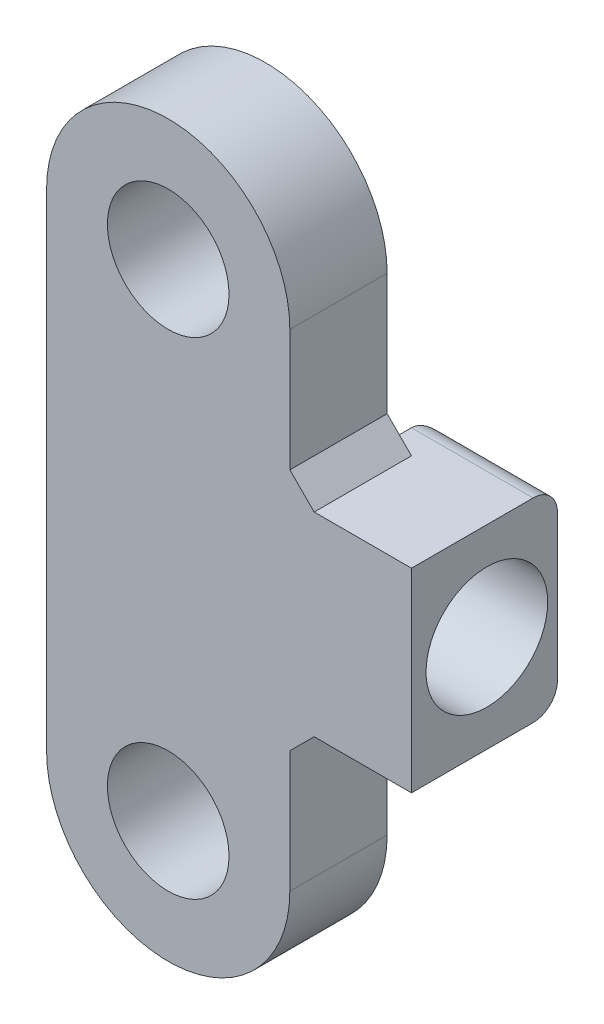
ISO-10303-21;
HEADER;
FILE_DESCRIPTION(('STEP AP214'),'2;1');
FILE_NAME('part.step','',(''),(''),'','','');
FILE_SCHEMA(('AUTOMOTIVE_DESIGN { 1 0 10303 214 1 1 1 1 }'));
ENDSEC;
DATA;
#1=APPLICATION_CONTEXT('core data for automotive mechanical design processes');
#2=APPLICATION_PROTOCOL_DEFINITION('international standard','automotive_design',2000,#1);
#3=PRODUCT_CONTEXT('',#1,'mechanical');
#4=PRODUCT('Part','Part','',(#3));
#5=PRODUCT_RELATED_PRODUCT_CATEGORY('part','',(#4));
#6=PRODUCT_DEFINITION_FORMATION('','',#4);
#7=PRODUCT_DEFINITION_CONTEXT('part definition',#1,'design');
#8=PRODUCT_DEFINITION('design','',#6,#7);
#9=PRODUCT_DEFINITION_SHAPE('','',#8);
#10=(LENGTH_UNIT() NAMED_UNIT(*) SI_UNIT(.MILLI.,.METRE.));
#11=(NAMED_UNIT(*) PLANE_ANGLE_UNIT() SI_UNIT($,.RADIAN.));
#12=(NAMED_UNIT(*) SI_UNIT($,.STERADIAN.) SOLID_ANGLE_UNIT());
#13=UNCERTAINTY_MEASURE_WITH_UNIT(LENGTH_MEASURE(1.E-05),#10,'distance_accuracy_value','');
#14=(GEOMETRIC_REPRESENTATION_CONTEXT(3) GLOBAL_UNCERTAINTY_ASSIGNED_CONTEXT((#13)) GLOBAL_UNIT_ASSIGNED_CONTEXT((#10,
#11,#12)) REPRESENTATION_CONTEXT('',''));
#15=CARTESIAN_POINT('',(0.,0.,0.));
#16=DIRECTION('',(0.,0.,1.));
#17=DIRECTION('',(1.,0.,0.));
#18=AXIS2_PLACEMENT_3D('',#15,#16,#17);
#19=CARTESIAN_POINT('',(5.,0.,0.));
#20=DIRECTION('',(1.,0.,0.));
#21=DIRECTION('',(0.,0.,-1.));
#22=AXIS2_PLACEMENT_3D('',#19,#20,#21);
#23=PLANE('',#22);
#24=DIRECTION('',(0.,0.,1.));
#25=VECTOR('',#24,1.);
#26=CARTESIAN_POINT('',(5.,4.,4.));
#27=LINE('',#26,#25);
#28=CARTESIAN_POINT('',(5.,4.,-1.));
#29=VERTEX_POINT('',#28);
#30=CARTESIAN_POINT('',(5.,4.,0.));
#31=VERTEX_POINT('',#30);
#32=EDGE_CURVE('E180',#29,#31,#27,.T.);
#33=ORIENTED_EDGE('',*,*,#32,.F.);
#34=DIRECTION('',(0.,1.,0.));
#35=VECTOR('',#34,1.);
#36=CARTESIAN_POINT('',(5.,0.,-1.));
#37=LINE('',#36,#35);
#38=CARTESIAN_POINT('',(5.,1.62480768092719,-1.));
#39=VERTEX_POINT('',#38);
#40=EDGE_CURVE('E52',#29,#39,#37,.F.);
#41=ORIENTED_EDGE('',*,*,#40,.T.);
#42=CARTESIAN_POINT('',(5.,0.,0.9));
#43=DIRECTION('',(1.,0.,0.));
#44=DIRECTION('',(0.,0.,-1.));
#45=AXIS2_PLACEMENT_3D('',#42,#43,#44);
#46=CIRCLE('',#45,2.5);
#47=CARTESIAN_POINT('',(5.,2.33238075793812,0.));
#48=VERTEX_POINT('',#47);
#49=EDGE_CURVE('E373',#39,#48,#46,.T.);
#50=ORIENTED_EDGE('',*,*,#49,.T.);
#51=DIRECTION('',(0.,-1.,0.));
#52=VECTOR('',#51,1.);
#53=CARTESIAN_POINT('',(5.,0.,0.));
#54=LINE('',#53,#52);
#55=EDGE_CURVE('E227',#31,#48,#54,.T.);
#56=ORIENTED_EDGE('',*,*,#55,.F.);
#57=EDGE_LOOP('',(#33,#41,#50,#56));
#58=FACE_BOUND('',#57,.T.);
#59=ADVANCED_FACE('F43',(#58),#23,.F.);
#60=CARTESIAN_POINT('',(5.,0.,4.));
#61=DIRECTION('',(1.,0.,0.));
#62=DIRECTION('',(0.,0.,-1.));
#63=AXIS2_PLACEMENT_3D('',#60,#61,#62);
#64=PLANE('',#63);
#65=CARTESIAN_POINT('',(5.,-5.,0.));
#66=VERTEX_POINT('',#65);
#67=CARTESIAN_POINT('',(5.,-10.,0.));
#68=VERTEX_POINT('',#67);
#69=EDGE_CURVE('E223',#66,#68,#54,.T.);
#70=ORIENTED_EDGE('',*,*,#69,.F.);
#71=DIRECTION('',(0.,0.,1.));
#72=VECTOR('',#71,1.);
#73=CARTESIAN_POINT('',(5.,-5.,4.));
#74=LINE('',#73,#72);
#75=CARTESIAN_POINT('',(5.,-5.,4.));
#76=VERTEX_POINT('',#75);
#77=EDGE_CURVE('E243',#66,#76,#74,.T.);
#78=ORIENTED_EDGE('',*,*,#77,.T.);
#79=DIRECTION('',(0.,-1.,0.));
#80=VECTOR('',#79,1.);
#81=CARTESIAN_POINT('',(5.,0.,4.));
#82=LINE('',#81,#80);
#83=CARTESIAN_POINT('',(5.,-10.,4.));
#84=VERTEX_POINT('',#83);
#85=EDGE_CURVE('E208',#76,#84,#82,.T.);
#86=ORIENTED_EDGE('',*,*,#85,.T.);
#87=DIRECTION('',(0.,0.,-1.));
#88=VECTOR('',#87,1.);
#89=CARTESIAN_POINT('',(5.,-10.,4.));
#90=LINE('',#89,#88);
#91=EDGE_CURVE('E233',#84,#68,#90,.T.);
#92=ORIENTED_EDGE('',*,*,#91,.T.);
#93=EDGE_LOOP('',(#70,#78,#86,#92));
#94=FACE_BOUND('',#93,.T.);
#95=ADVANCED_FACE('F330',(#94),#64,.T.);
#96=CARTESIAN_POINT('',(5.,-2.33238075793812,0.));
#97=VERTEX_POINT('',#96);
#98=EDGE_CURVE('E388',#48,#97,#46,.T.);
#99=ORIENTED_EDGE('',*,*,#98,.T.);
#100=EDGE_CURVE('E399',#48,#97,#54,.T.);
#101=ORIENTED_EDGE('',*,*,#100,.F.);
#102=EDGE_LOOP('',(#99,#101));
#103=FACE_BOUND('',#102,.T.);
#104=ADVANCED_FACE('F322',(#103),#64,.T.);
#105=CARTESIAN_POINT('',(-5.,0.,4.));
#106=DIRECTION('',(1.,0.,0.));
#107=DIRECTION('',(0.,0.,-1.));
#108=AXIS2_PLACEMENT_3D('',#105,#106,#107);
#109=PLANE('',#108);
#110=DIRECTION('',(0.,-1.,0.));
#111=VECTOR('',#110,1.);
#112=CARTESIAN_POINT('',(-5.,0.,0.));
#113=LINE('',#112,#111);
#114=CARTESIAN_POINT('',(-5.,10.,0.));
#115=VERTEX_POINT('',#114);
#116=CARTESIAN_POINT('',(-5.,-10.,0.));
#117=VERTEX_POINT('',#116);
#118=EDGE_CURVE('E217',#115,#117,#113,.T.);
#119=ORIENTED_EDGE('',*,*,#118,.T.);
#120=DIRECTION('',(0.,0.,-1.));
#121=VECTOR('',#120,1.);
#122=CARTESIAN_POINT('',(-5.,-10.,4.));
#123=LINE('',#122,#121);
#124=CARTESIAN_POINT('',(-5.,-10.,4.));
#125=VERTEX_POINT('',#124);
#126=EDGE_CURVE('E236',#125,#117,#123,.T.);
#127=ORIENTED_EDGE('',*,*,#126,.F.);
#128=DIRECTION('',(0.,-1.,0.));
#129=VECTOR('',#128,1.);
#130=CARTESIAN_POINT('',(-5.,0.,4.));
#131=LINE('',#130,#129);
#132=CARTESIAN_POINT('',(-5.,10.,4.));
#133=VERTEX_POINT('',#132);
#134=EDGE_CURVE('E203',#133,#125,#131,.T.);
#135=ORIENTED_EDGE('',*,*,#134,.F.);
#136=DIRECTION('',(0.,0.,-1.));
#137=VECTOR('',#136,1.);
#138=CARTESIAN_POINT('',(-5.,10.,4.));
#139=LINE('',#138,#137);
#140=EDGE_CURVE('E213',#133,#115,#139,.T.);
#141=ORIENTED_EDGE('',*,*,#140,.T.);
#142=EDGE_LOOP('',(#119,#127,#135,#141));
#143=FACE_BOUND('',#142,.T.);
#144=ADVANCED_FACE('F318',(#143),#109,.F.);
#145=CARTESIAN_POINT('',(0.,-10.,4.));
#146=DIRECTION('',(0.,0.,-1.));
#147=DIRECTION('',(-1.,0.,0.));
#148=AXIS2_PLACEMENT_3D('',#145,#146,#147);
#149=CYLINDRICAL_SURFACE('',#148,5.);
#150=CARTESIAN_POINT('',(0.,-10.,0.));
#151=DIRECTION('',(0.,0.,1.));
#152=DIRECTION('',(1.,0.,0.));
#153=AXIS2_PLACEMENT_3D('',#150,#151,#152);
#154=CIRCLE('',#153,5.);
#155=EDGE_CURVE('E220',#117,#68,#154,.T.);
#156=ORIENTED_EDGE('',*,*,#155,.T.);
#157=ORIENTED_EDGE('',*,*,#91,.F.);
#158=CARTESIAN_POINT('',(0.,-10.,4.));
#159=DIRECTION('',(0.,0.,1.));
#160=DIRECTION('',(1.,0.,0.));
#161=AXIS2_PLACEMENT_3D('',#158,#159,#160);
#162=CIRCLE('',#161,5.);
#163=EDGE_CURVE('E205',#125,#84,#162,.T.);
#164=ORIENTED_EDGE('',*,*,#163,.F.);
#165=ORIENTED_EDGE('',*,*,#126,.T.);
#166=EDGE_LOOP('',(#156,#157,#164,#165));
#167=FACE_BOUND('',#166,.T.);
#168=ADVANCED_FACE('F321',(#167),#149,.T.);
#169=CARTESIAN_POINT('',(5.,10.,4.));
#170=VERTEX_POINT('',#169);
#171=CARTESIAN_POINT('',(5.,5.,4.));
#172=VERTEX_POINT('',#171);
#173=EDGE_CURVE('E209',#170,#172,#82,.T.);
#174=ORIENTED_EDGE('',*,*,#173,.T.);
#175=DIRECTION('',(0.,0.,-1.));
#176=VECTOR('',#175,1.);
#177=CARTESIAN_POINT('',(5.,5.,4.));
#178=LINE('',#177,#176);
#179=CARTESIAN_POINT('',(5.,5.,0.));
#180=VERTEX_POINT('',#179);
#181=EDGE_CURVE('E251',#172,#180,#178,.T.);
#182=ORIENTED_EDGE('',*,*,#181,.T.);
#183=CARTESIAN_POINT('',(5.,10.,0.));
#184=VERTEX_POINT('',#183);
#185=EDGE_CURVE('E224',#184,#180,#54,.T.);
#186=ORIENTED_EDGE('',*,*,#185,.F.);
#187=DIRECTION('',(0.,0.,-1.));
#188=VECTOR('',#187,1.);
#189=CARTESIAN_POINT('',(5.,10.,4.));
#190=LINE('',#189,#188);
#191=EDGE_CURVE('E231',#170,#184,#190,.T.);
#192=ORIENTED_EDGE('',*,*,#191,.F.);
#193=EDGE_LOOP('',(#174,#182,#186,#192));
#194=FACE_BOUND('',#193,.T.);
#195=ADVANCED_FACE('F316',(#194),#64,.T.);
#196=CARTESIAN_POINT('',(0.,10.,4.));
#197=DIRECTION('',(0.,0.,-1.));
#198=DIRECTION('',(-1.,0.,0.));
#199=AXIS2_PLACEMENT_3D('',#196,#197,#198);
#200=CYLINDRICAL_SURFACE('',#199,2.5);
#201=CARTESIAN_POINT('',(0.,10.,4.));
#202=DIRECTION('',(0.,0.,1.));
#203=DIRECTION('',(1.,0.,0.));
#204=AXIS2_PLACEMENT_3D('',#201,#202,#203);
#205=CIRCLE('',#204,2.5);
#206=CARTESIAN_POINT('',(2.5,10.,4.));
#207=VERTEX_POINT('',#206);
#208=EDGE_CURVE('E199',#207,#207,#205,.T.);
#209=ORIENTED_EDGE('',*,*,#208,.T.);
#210=EDGE_LOOP('',(#209));
#211=FACE_BOUND('',#210,.T.);
#212=CARTESIAN_POINT('',(0.,10.,0.));
#213=DIRECTION('',(0.,0.,1.));
#214=DIRECTION('',(1.,0.,0.));
#215=AXIS2_PLACEMENT_3D('',#212,#213,#214);
#216=CIRCLE('',#215,2.5);
#217=CARTESIAN_POINT('',(2.5,10.,0.));
#218=VERTEX_POINT('',#217);
#219=EDGE_CURVE('E191',#218,#218,#216,.T.);
#220=ORIENTED_EDGE('',*,*,#219,.F.);
#221=EDGE_LOOP('',(#220));
#222=FACE_BOUND('',#221,.T.);
#223=ADVANCED_FACE('F312',(#211,#222),#200,.F.);
#224=CARTESIAN_POINT('',(0.,-10.,4.));
#225=DIRECTION('',(0.,0.,-1.));
#226=DIRECTION('',(-1.,0.,0.));
#227=AXIS2_PLACEMENT_3D('',#224,#225,#226);
#228=CYLINDRICAL_SURFACE('',#227,2.5);
#229=CARTESIAN_POINT('',(0.,-10.,4.));
#230=DIRECTION('',(0.,0.,1.));
#231=DIRECTION('',(1.,0.,0.));
#232=AXIS2_PLACEMENT_3D('',#229,#230,#231);
#233=CIRCLE('',#232,2.5);
#234=CARTESIAN_POINT('',(2.5,-10.,4.));
#235=VERTEX_POINT('',#234);
#236=EDGE_CURVE('E196',#235,#235,#233,.T.);
#237=ORIENTED_EDGE('',*,*,#236,.T.);
#238=EDGE_LOOP('',(#237));
#239=FACE_BOUND('',#238,.T.);
#240=CARTESIAN_POINT('',(0.,-10.,0.));
#241=DIRECTION('',(0.,0.,1.));
#242=DIRECTION('',(1.,0.,0.));
#243=AXIS2_PLACEMENT_3D('',#240,#241,#242);
#244=CIRCLE('',#243,2.5);
#245=CARTESIAN_POINT('',(2.5,-10.,0.));
#246=VERTEX_POINT('',#245);
#247=EDGE_CURVE('E187',#246,#246,#244,.T.);
#248=ORIENTED_EDGE('',*,*,#247,.F.);
#249=EDGE_LOOP('',(#248));
#250=FACE_BOUND('',#249,.T.);
#251=ADVANCED_FACE('F308',(#239,#250),#228,.F.);
#252=CARTESIAN_POINT('',(0.,10.,4.));
#253=DIRECTION('',(0.,0.,-1.));
#254=DIRECTION('',(-1.,0.,0.));
#255=AXIS2_PLACEMENT_3D('',#252,#253,#254);
#256=CYLINDRICAL_SURFACE('',#255,5.);
#257=CARTESIAN_POINT('',(0.,10.,0.));
#258=DIRECTION('',(0.,0.,1.));
#259=DIRECTION('',(1.,0.,0.));
#260=AXIS2_PLACEMENT_3D('',#257,#258,#259);
#261=CIRCLE('',#260,5.);
#262=EDGE_CURVE('E200',#184,#115,#261,.T.);
#263=ORIENTED_EDGE('',*,*,#262,.T.);
#264=ORIENTED_EDGE('',*,*,#140,.F.);
#265=CARTESIAN_POINT('',(0.,10.,4.));
#266=DIRECTION('',(0.,0.,1.));
#267=DIRECTION('',(1.,0.,0.));
#268=AXIS2_PLACEMENT_3D('',#265,#266,#267);
#269=CIRCLE('',#268,5.);
#270=EDGE_CURVE('E212',#170,#133,#269,.T.);
#271=ORIENTED_EDGE('',*,*,#270,.F.);
#272=ORIENTED_EDGE('',*,*,#191,.T.);
#273=EDGE_LOOP('',(#263,#264,#271,#272));
#274=FACE_BOUND('',#273,.T.);
#275=ADVANCED_FACE('F311',(#274),#256,.T.);
#276=CARTESIAN_POINT('',(0.,0.,4.));
#277=DIRECTION('',(0.,0.,1.));
#278=DIRECTION('',(1.,0.,0.));
#279=AXIS2_PLACEMENT_3D('',#276,#277,#278);
#280=PLANE('',#279);
#281=ORIENTED_EDGE('',*,*,#236,.F.);
#282=EDGE_LOOP('',(#281));
#283=FACE_BOUND('',#282,.T.);
#284=ORIENTED_EDGE('',*,*,#208,.F.);
#285=EDGE_LOOP('',(#284));
#286=FACE_BOUND('',#285,.T.);
#287=ORIENTED_EDGE('',*,*,#134,.T.);
#288=ORIENTED_EDGE('',*,*,#163,.T.);
#289=ORIENTED_EDGE('',*,*,#85,.F.);
#290=DIRECTION('',(0.707106781186551,0.707106781186544,0.));
#291=VECTOR('',#290,1.);
#292=CARTESIAN_POINT('',(6.00000000000001,-4.,4.));
#293=LINE('',#292,#291);
#294=CARTESIAN_POINT('',(6.00000000000001,-4.,4.));
#295=VERTEX_POINT('',#294);
#296=EDGE_CURVE('E186',#76,#295,#293,.T.);
#297=ORIENTED_EDGE('',*,*,#296,.T.);
#298=DIRECTION('',(-1.,0.,0.));
#299=VECTOR('',#298,1.);
#300=CARTESIAN_POINT('',(10.,-4.,4.));
#301=LINE('',#300,#299);
#302=CARTESIAN_POINT('',(10.,-4.,4.));
#303=VERTEX_POINT('',#302);
#304=EDGE_CURVE('E163',#303,#295,#301,.T.);
#305=ORIENTED_EDGE('',*,*,#304,.F.);
#306=DIRECTION('',(0.,-1.,0.));
#307=VECTOR('',#306,1.);
#308=CARTESIAN_POINT('',(10.,4.,4.));
#309=LINE('',#308,#307);
#310=CARTESIAN_POINT('',(10.,4.,4.));
#311=VERTEX_POINT('',#310);
#312=EDGE_CURVE('E170',#311,#303,#309,.T.);
#313=ORIENTED_EDGE('',*,*,#312,.F.);
#314=DIRECTION('',(-1.,0.,0.));
#315=VECTOR('',#314,1.);
#316=CARTESIAN_POINT('',(10.,4.,4.));
#317=LINE('',#316,#315);
#318=CARTESIAN_POINT('',(6.00000000000001,4.,4.));
#319=VERTEX_POINT('',#318);
#320=EDGE_CURVE('E188',#311,#319,#317,.T.);
#321=ORIENTED_EDGE('',*,*,#320,.T.);
#322=DIRECTION('',(-0.707106781186551,0.707106781186544,0.));
#323=VECTOR('',#322,1.);
#324=CARTESIAN_POINT('',(6.00000000000001,4.,4.));
#325=LINE('',#324,#323);
#326=EDGE_CURVE('E256',#319,#172,#325,.T.);
#327=ORIENTED_EDGE('',*,*,#326,.T.);
#328=ORIENTED_EDGE('',*,*,#173,.F.);
#329=ORIENTED_EDGE('',*,*,#270,.T.);
#330=EDGE_LOOP('',(#287,#288,#289,#297,#305,#313,#321,#327,#328,#329));
#331=FACE_BOUND('',#330,.T.);
#332=ADVANCED_FACE('F183',(#283,#286,#331),#280,.T.);
#333=CARTESIAN_POINT('',(0.,0.,0.));
#334=DIRECTION('',(0.,0.,1.));
#335=DIRECTION('',(1.,0.,0.));
#336=AXIS2_PLACEMENT_3D('',#333,#334,#335);
#337=PLANE('',#336);
#338=ORIENTED_EDGE('',*,*,#247,.T.);
#339=EDGE_LOOP('',(#338));
#340=FACE_BOUND('',#339,.T.);
#341=ORIENTED_EDGE('',*,*,#219,.T.);
#342=EDGE_LOOP('',(#341));
#343=FACE_BOUND('',#342,.T.);
#344=ORIENTED_EDGE('',*,*,#118,.F.);
#345=ORIENTED_EDGE('',*,*,#262,.F.);
#346=ORIENTED_EDGE('',*,*,#185,.T.);
#347=DIRECTION('',(0.707106781186551,-0.707106781186544,0.));
#348=VECTOR('',#347,1.);
#349=CARTESIAN_POINT('',(4.99999999999997,5.00000000000002,0.));
#350=LINE('',#349,#348);
#351=CARTESIAN_POINT('',(6.00000000000001,4.,0.));
#352=VERTEX_POINT('',#351);
#353=EDGE_CURVE('E258',#180,#352,#350,.T.);
#354=ORIENTED_EDGE('',*,*,#353,.T.);
#355=DIRECTION('',(1.,0.,0.));
#356=VECTOR('',#355,1.);
#357=CARTESIAN_POINT('',(0.,4.,0.));
#358=LINE('',#357,#356);
#359=EDGE_CURVE('E245',#31,#352,#358,.T.);
#360=ORIENTED_EDGE('',*,*,#359,.F.);
#361=ORIENTED_EDGE('',*,*,#55,.T.);
#362=ORIENTED_EDGE('',*,*,#100,.T.);
#363=CARTESIAN_POINT('',(5.,-4.,0.));
#364=VERTEX_POINT('',#363);
#365=EDGE_CURVE('E401',#97,#364,#54,.T.);
#366=ORIENTED_EDGE('',*,*,#365,.T.);
#367=DIRECTION('',(-1.,0.,0.));
#368=VECTOR('',#367,1.);
#369=CARTESIAN_POINT('',(0.,-4.,0.));
#370=LINE('',#369,#368);
#371=CARTESIAN_POINT('',(6.00000000000001,-4.,0.));
#372=VERTEX_POINT('',#371);
#373=EDGE_CURVE('E239',#372,#364,#370,.T.);
#374=ORIENTED_EDGE('',*,*,#373,.F.);
#375=DIRECTION('',(-0.707106781186551,-0.707106781186544,0.));
#376=VECTOR('',#375,1.);
#377=CARTESIAN_POINT('',(4.99999999999997,-5.00000000000002,0.));
#378=LINE('',#377,#376);
#379=EDGE_CURVE('E253',#372,#66,#378,.T.);
#380=ORIENTED_EDGE('',*,*,#379,.T.);
#381=ORIENTED_EDGE('',*,*,#69,.T.);
#382=ORIENTED_EDGE('',*,*,#155,.F.);
#383=EDGE_LOOP('',(#344,#345,#346,#354,#360,#361,#362,#366,#374,#380,#381,#382));
#384=FACE_BOUND('',#383,.T.);
#385=ADVANCED_FACE('F334',(#340,#343,#384),#337,.F.);
#386=CARTESIAN_POINT('',(5.,-1.62480768092719,-1.));
#387=VERTEX_POINT('',#386);
#388=EDGE_CURVE('E378',#97,#387,#46,.T.);
#389=ORIENTED_EDGE('',*,*,#388,.T.);
#390=DIRECTION('',(0.,1.,0.));
#391=VECTOR('',#390,1.);
#392=CARTESIAN_POINT('',(5.,0.,-1.));
#393=LINE('',#392,#391);
#394=CARTESIAN_POINT('',(5.,-4.,-1.));
#395=VERTEX_POINT('',#394);
#396=EDGE_CURVE('E274',#387,#395,#393,.F.);
#397=ORIENTED_EDGE('',*,*,#396,.T.);
#398=DIRECTION('',(0.,0.,-1.));
#399=VECTOR('',#398,1.);
#400=CARTESIAN_POINT('',(5.,-4.,4.));
#401=LINE('',#400,#399);
#402=EDGE_CURVE('E366',#364,#395,#401,.T.);
#403=ORIENTED_EDGE('',*,*,#402,.F.);
#404=ORIENTED_EDGE('',*,*,#365,.F.);
#405=EDGE_LOOP('',(#389,#397,#403,#404));
#406=FACE_BOUND('',#405,.T.);
#407=ADVANCED_FACE('F337',(#406),#23,.F.);
#408=CARTESIAN_POINT('',(10.,0.,0.));
#409=DIRECTION('',(1.,0.,0.));
#410=DIRECTION('',(0.,0.,-1.));
#411=AXIS2_PLACEMENT_3D('',#408,#409,#410);
#412=PLANE('',#411);
#413=DIRECTION('',(0.,0.,-1.));
#414=VECTOR('',#413,1.);
#415=CARTESIAN_POINT('',(10.,-4.,4.));
#416=LINE('',#415,#414);
#417=CARTESIAN_POINT('',(10.,-4.,-1.));
#418=VERTEX_POINT('',#417);
#419=EDGE_CURVE('E157',#303,#418,#416,.T.);
#420=ORIENTED_EDGE('',*,*,#419,.T.);
#421=CARTESIAN_POINT('',(10.,-3.,-1.));
#422=DIRECTION('',(1.,0.,0.));
#423=DIRECTION('',(0.,0.,-1.));
#424=AXIS2_PLACEMENT_3D('',#421,#422,#423);
#425=CIRCLE('',#424,1.);
#426=CARTESIAN_POINT('',(10.,-3.,-2.));
#427=VERTEX_POINT('',#426);
#428=EDGE_CURVE('E270',#418,#427,#425,.T.);
#429=ORIENTED_EDGE('',*,*,#428,.T.);
#430=DIRECTION('',(0.,1.,0.));
#431=VECTOR('',#430,1.);
#432=CARTESIAN_POINT('',(10.,4.,-2.));
#433=LINE('',#432,#431);
#434=CARTESIAN_POINT('',(10.,3.,-2.));
#435=VERTEX_POINT('',#434);
#436=EDGE_CURVE('E169',#427,#435,#433,.T.);
#437=ORIENTED_EDGE('',*,*,#436,.T.);
#438=CARTESIAN_POINT('',(10.,3.,-1.));
#439=DIRECTION('',(1.,0.,0.));
#440=DIRECTION('',(0.,0.,-1.));
#441=AXIS2_PLACEMENT_3D('',#438,#439,#440);
#442=CIRCLE('',#441,1.);
#443=CARTESIAN_POINT('',(10.,4.,-1.));
#444=VERTEX_POINT('',#443);
#445=EDGE_CURVE('E268',#435,#444,#442,.T.);
#446=ORIENTED_EDGE('',*,*,#445,.T.);
#447=DIRECTION('',(0.,0.,1.));
#448=VECTOR('',#447,1.);
#449=CARTESIAN_POINT('',(10.,4.,4.));
#450=LINE('',#449,#448);
#451=EDGE_CURVE('E176',#444,#311,#450,.T.);
#452=ORIENTED_EDGE('',*,*,#451,.T.);
#453=ORIENTED_EDGE('',*,*,#312,.T.);
#454=EDGE_LOOP('',(#420,#429,#437,#446,#452,#453));
#455=FACE_BOUND('',#454,.T.);
#456=CARTESIAN_POINT('',(10.,0.,0.9));
#457=DIRECTION('',(1.,0.,0.));
#458=DIRECTION('',(0.,0.,-1.));
#459=AXIS2_PLACEMENT_3D('',#456,#457,#458);
#460=CIRCLE('',#459,2.5);
#461=CARTESIAN_POINT('',(10.,0.,-1.6));
#462=VERTEX_POINT('',#461);
#463=EDGE_CURVE('E380',#462,#462,#460,.T.);
#464=ORIENTED_EDGE('',*,*,#463,.F.);
#465=EDGE_LOOP('',(#464));
#466=FACE_BOUND('',#465,.T.);
#467=ADVANCED_FACE('F173',(#455,#466),#412,.T.);
#468=CARTESIAN_POINT('',(10.,-4.,4.));
#469=DIRECTION('',(0.,1.,0.));
#470=DIRECTION('',(0.,0.,1.));
#471=AXIS2_PLACEMENT_3D('',#468,#469,#470);
#472=PLANE('',#471);
#473=ORIENTED_EDGE('',*,*,#402,.T.);
#474=DIRECTION('',(-1.,0.,0.));
#475=VECTOR('',#474,1.);
#476=CARTESIAN_POINT('',(10.,-4.,-1.));
#477=LINE('',#476,#475);
#478=EDGE_CURVE('E166',#395,#418,#477,.F.);
#479=ORIENTED_EDGE('',*,*,#478,.T.);
#480=ORIENTED_EDGE('',*,*,#419,.F.);
#481=ORIENTED_EDGE('',*,*,#304,.T.);
#482=DIRECTION('',(0.,0.,-1.));
#483=VECTOR('',#482,1.);
#484=CARTESIAN_POINT('',(6.00000000000001,-4.,4.));
#485=LINE('',#484,#483);
#486=EDGE_CURVE('E241',#295,#372,#485,.T.);
#487=ORIENTED_EDGE('',*,*,#486,.T.);
#488=ORIENTED_EDGE('',*,*,#373,.T.);
#489=EDGE_LOOP('',(#473,#479,#480,#481,#487,#488));
#490=FACE_BOUND('',#489,.T.);
#491=ADVANCED_FACE('F160',(#490),#472,.F.);
#492=CARTESIAN_POINT('',(10.,4.,-2.));
#493=DIRECTION('',(0.,0.,1.));
#494=DIRECTION('',(1.,0.,0.));
#495=AXIS2_PLACEMENT_3D('',#492,#493,#494);
#496=PLANE('',#495);
#497=ORIENTED_EDGE('',*,*,#436,.F.);
#498=DIRECTION('',(-1.,0.,0.));
#499=VECTOR('',#498,1.);
#500=CARTESIAN_POINT('',(10.,-3.,-2.));
#501=LINE('',#500,#499);
#502=CARTESIAN_POINT('',(6.,-3.,-2.));
#503=VERTEX_POINT('',#502);
#504=EDGE_CURVE('E264',#427,#503,#501,.T.);
#505=ORIENTED_EDGE('',*,*,#504,.T.);
#506=DIRECTION('',(0.,1.,0.));
#507=VECTOR('',#506,1.);
#508=CARTESIAN_POINT('',(6.,4.,-2.));
#509=LINE('',#508,#507);
#510=CARTESIAN_POINT('',(6.,3.,-2.));
#511=VERTEX_POINT('',#510);
#512=EDGE_CURVE('E260',#503,#511,#509,.T.);
#513=ORIENTED_EDGE('',*,*,#512,.T.);
#514=DIRECTION('',(-1.,0.,0.));
#515=VECTOR('',#514,1.);
#516=CARTESIAN_POINT('',(10.,3.,-2.));
#517=LINE('',#516,#515);
#518=EDGE_CURVE('E262',#511,#435,#517,.F.);
#519=ORIENTED_EDGE('',*,*,#518,.T.);
#520=EDGE_LOOP('',(#497,#505,#513,#519));
#521=FACE_BOUND('',#520,.T.);
#522=ADVANCED_FACE('F344',(#521),#496,.F.);
#523=CARTESIAN_POINT('',(10.,4.,4.));
#524=DIRECTION('',(0.,-1.,0.));
#525=DIRECTION('',(0.,0.,-1.));
#526=AXIS2_PLACEMENT_3D('',#523,#524,#525);
#527=PLANE('',#526);
#528=ORIENTED_EDGE('',*,*,#451,.F.);
#529=DIRECTION('',(-1.,0.,0.));
#530=VECTOR('',#529,1.);
#531=CARTESIAN_POINT('',(10.,4.,-1.));
#532=LINE('',#531,#530);
#533=EDGE_CURVE('E272',#444,#29,#532,.T.);
#534=ORIENTED_EDGE('',*,*,#533,.T.);
#535=ORIENTED_EDGE('',*,*,#32,.T.);
#536=ORIENTED_EDGE('',*,*,#359,.T.);
#537=DIRECTION('',(0.,0.,1.));
#538=VECTOR('',#537,1.);
#539=CARTESIAN_POINT('',(6.00000000000001,4.,4.));
#540=LINE('',#539,#538);
#541=EDGE_CURVE('E248',#352,#319,#540,.T.);
#542=ORIENTED_EDGE('',*,*,#541,.T.);
#543=ORIENTED_EDGE('',*,*,#320,.F.);
#544=EDGE_LOOP('',(#528,#534,#535,#536,#542,#543));
#545=FACE_BOUND('',#544,.T.);
#546=ADVANCED_FACE('F347',(#545),#527,.F.);
#547=CARTESIAN_POINT('',(10.,0.,0.9));
#548=DIRECTION('',(-1.,0.,0.));
#549=DIRECTION('',(0.,0.,1.));
#550=AXIS2_PLACEMENT_3D('',#547,#548,#549);
#551=CYLINDRICAL_SURFACE('',#550,2.5);
#552=ORIENTED_EDGE('',*,*,#463,.T.);
#553=EDGE_LOOP('',(#552));
#554=FACE_BOUND('',#553,.T.);
#555=ORIENTED_EDGE('',*,*,#49,.F.);
#556=CARTESIAN_POINT('',(5.,1.62480768092719,-1.));
#557=CARTESIAN_POINT('',(5.00001490454935,1.58111372843532,-1.0373753640214));
#558=CARTESIAN_POINT('',(5.00209327577601,1.53616877275101,-1.07319127686543));
#559=CARTESIAN_POINT('',(5.00946103897857,1.4441692871249,-1.14147995459923));
#560=CARTESIAN_POINT('',(5.01474478895979,1.39711859809493,-1.17395847665152));
#561=CARTESIAN_POINT('',(5.02760580330214,1.30120441548298,-1.23544206348932));
#562=CARTESIAN_POINT('',(5.035180196457,1.2523432581241,-1.26445141355069));
#563=CARTESIAN_POINT('',(5.0518136687314,1.15294549323573,-1.31899312493479));
#564=CARTESIAN_POINT('',(5.06087347387586,1.10240807608447,-1.34452377474351));
#565=CARTESIAN_POINT('',(5.0900132963811,0.943689422464773,-1.41807685308622));
#566=CARTESIAN_POINT('',(5.11130753885694,0.832923548356059,-1.4601538886037));
#567=CARTESIAN_POINT('',(5.15005113479199,0.605928985781737,-1.52834310362288));
#568=CARTESIAN_POINT('',(5.16750344884972,0.489704588065418,-1.55446760391824));
#569=CARTESIAN_POINT('',(5.18593252365555,0.314208151834321,-1.58085915950448));
#570=CARTESIAN_POINT('',(5.19076924763491,0.256266212945156,-1.58751652300761));
#571=CARTESIAN_POINT('',(5.19756191084918,0.13988304466347,-1.59676534766998));
#572=CARTESIAN_POINT('',(5.1995181590546,0.0814418694973513,-1.59935724490816));
#573=CARTESIAN_POINT('',(5.20032340748299,-0.0354778254982766,-1.60043148136473));
#574=CARTESIAN_POINT('',(5.19917361202601,-0.093956322066647,-1.59891541338196));
#575=CARTESIAN_POINT('',(5.19390873230304,-0.21052265802357,-1.59180523110373));
#576=CARTESIAN_POINT('',(5.18979338847852,-0.268610462767754,-1.58621075984701));
#577=CARTESIAN_POINT('',(5.17366970374435,-0.44103079177742,-1.56350642283122));
#578=CARTESIAN_POINT('',(5.15788011132969,-0.554265312438609,-1.54048062870075));
#579=CARTESIAN_POINT('',(5.12166700250293,-0.775882412281811,-1.47934376401609));
#580=CARTESIAN_POINT('',(5.10123630901778,-0.884257162106191,-1.4412092604219));
#581=CARTESIAN_POINT('',(5.07106279196767,-1.04664761013724,-1.37120701408502));
#582=CARTESIAN_POINT('',(5.06071379699591,-1.10280845434983,-1.34447993799407));
#583=CARTESIAN_POINT('',(5.04152863122579,-1.21316762339975,-1.28680145756161));
#584=CARTESIAN_POINT('',(5.03269170579962,-1.26736691647536,-1.25585217433792));
#585=CARTESIAN_POINT('',(5.01758370173652,-1.373606574281,-1.18976427248542));
#586=CARTESIAN_POINT('',(5.01131446941888,-1.42564536140564,-1.15462266269569));
#587=CARTESIAN_POINT('',(5.00252954671394,-1.5272299714697,-1.08029088568571));
#588=CARTESIAN_POINT('',(5.00002156752729,-1.57677047223346,-1.04109257684064));
#589=CARTESIAN_POINT('',(4.99999999999997,-1.62480768092719,-1.00000000000001));
#590=B_SPLINE_CURVE_WITH_KNOTS('',3,(#556,#557,#558,#559,#560,#561,#562,#563,#564,#565,#566,
#567,#568,#569,#570,#571,#572,#573,#574,#575,#576,#577,#578,#579,#580,#581,#582,#583,#584,#585,
#586,#587,#588,#589),.UNSPECIFIED.,.F.,.F.,(4,2,2,2,2,2,2,2,2,2,2,2,2,2,2,2,4),(0.,
0.172334655280633,0.344366849756132,0.516184298019956,0.688085977240071,1.04802438460702,
1.40768444408153,1.58307010653895,1.75843695510891,1.93373581767554,2.10905002507511,
2.45747195632281,2.80643640569402,2.9954340285319,3.18433705155159,3.3733756692601,
3.56280132059546),.UNSPECIFIED.);
#591=EDGE_CURVE('E11',#39,#387,#590,.T.);
#592=ORIENTED_EDGE('',*,*,#591,.T.);
#593=ORIENTED_EDGE('',*,*,#388,.F.);
#594=ORIENTED_EDGE('',*,*,#98,.F.);
#595=EDGE_LOOP('',(#555,#592,#593,#594));
#596=FACE_BOUND('',#595,.T.);
#597=ADVANCED_FACE('F282',(#554,#596),#551,.F.);
#598=CARTESIAN_POINT('',(6.00000000000001,-4.,4.));
#599=DIRECTION('',(-0.707106781186544,0.707106781186551,0.));
#600=DIRECTION('',(0.,0.,-1.));
#601=AXIS2_PLACEMENT_3D('',#598,#599,#600);
#602=PLANE('',#601);
#603=ORIENTED_EDGE('',*,*,#296,.F.);
#604=ORIENTED_EDGE('',*,*,#77,.F.);
#605=ORIENTED_EDGE('',*,*,#379,.F.);
#606=ORIENTED_EDGE('',*,*,#486,.F.);
#607=EDGE_LOOP('',(#603,#604,#605,#606));
#608=FACE_BOUND('',#607,.T.);
#609=ADVANCED_FACE('F301',(#608),#602,.F.);
#610=CARTESIAN_POINT('',(6.00000000000001,4.,4.));
#611=DIRECTION('',(-0.707106781186544,-0.707106781186551,0.));
#612=DIRECTION('',(0.,0.,1.));
#613=AXIS2_PLACEMENT_3D('',#610,#611,#612);
#614=PLANE('',#613);
#615=ORIENTED_EDGE('',*,*,#353,.F.);
#616=ORIENTED_EDGE('',*,*,#181,.F.);
#617=ORIENTED_EDGE('',*,*,#326,.F.);
#618=ORIENTED_EDGE('',*,*,#541,.F.);
#619=EDGE_LOOP('',(#615,#616,#617,#618));
#620=FACE_BOUND('',#619,.T.);
#621=ADVANCED_FACE('F295',(#620),#614,.F.);
#622=CARTESIAN_POINT('',(10.,3.,-1.));
#623=DIRECTION('',(-1.,0.,0.));
#624=DIRECTION('',(0.,0.,1.));
#625=AXIS2_PLACEMENT_3D('',#622,#623,#624);
#626=CYLINDRICAL_SURFACE('',#625,1.);
#627=ORIENTED_EDGE('',*,*,#445,.F.);
#628=ORIENTED_EDGE('',*,*,#518,.F.);
#629=CARTESIAN_POINT('',(6.,3.,-1.));
#630=DIRECTION('',(0.707106781186547,0.707106781186547,0.));
#631=DIRECTION('',(-0.707106781186547,0.707106781186547,0.));
#632=AXIS2_PLACEMENT_3D('',#629,#630,#631);
#633=ELLIPSE('',#632,1.41421356237309,1.);
#634=EDGE_CURVE('E47',#29,#511,#633,.F.);
#635=ORIENTED_EDGE('',*,*,#634,.F.);
#636=ORIENTED_EDGE('',*,*,#533,.F.);
#637=EDGE_LOOP('',(#627,#628,#635,#636));
#638=FACE_BOUND('',#637,.T.);
#639=ADVANCED_FACE('F45',(#638),#626,.T.);
#640=CARTESIAN_POINT('',(6.,4.,-1.));
#641=DIRECTION('',(0.,1.,0.));
#642=DIRECTION('',(0.,0.,1.));
#643=AXIS2_PLACEMENT_3D('',#640,#641,#642);
#644=CYLINDRICAL_SURFACE('',#643,1.);
#645=ORIENTED_EDGE('',*,*,#634,.T.);
#646=ORIENTED_EDGE('',*,*,#512,.F.);
#647=CARTESIAN_POINT('',(6.,-3.,-1.));
#648=DIRECTION('',(-0.707106781186547,0.707106781186547,0.));
#649=DIRECTION('',(0.707106781186547,0.707106781186547,0.));
#650=AXIS2_PLACEMENT_3D('',#647,#648,#649);
#651=ELLIPSE('',#650,1.41421356237309,1.);
#652=EDGE_CURVE('E281',#395,#503,#651,.F.);
#653=ORIENTED_EDGE('',*,*,#652,.F.);
#654=ORIENTED_EDGE('',*,*,#396,.F.);
#655=ORIENTED_EDGE('',*,*,#591,.F.);
#656=ORIENTED_EDGE('',*,*,#40,.F.);
#657=EDGE_LOOP('',(#645,#646,#653,#654,#655,#656));
#658=FACE_BOUND('',#657,.T.);
#659=ADVANCED_FACE('F285',(#658),#644,.T.);
#660=CARTESIAN_POINT('',(10.,-3.,-1.));
#661=DIRECTION('',(-1.,0.,0.));
#662=DIRECTION('',(0.,0.,1.));
#663=AXIS2_PLACEMENT_3D('',#660,#661,#662);
#664=CYLINDRICAL_SURFACE('',#663,1.);
#665=ORIENTED_EDGE('',*,*,#428,.F.);
#666=ORIENTED_EDGE('',*,*,#478,.F.);
#667=ORIENTED_EDGE('',*,*,#652,.T.);
#668=ORIENTED_EDGE('',*,*,#504,.F.);
#669=EDGE_LOOP('',(#665,#666,#667,#668));
#670=FACE_BOUND('',#669,.T.);
#671=ADVANCED_FACE('F289',(#670),#664,.T.);
#672=CLOSED_SHELL('',(#59,#95,#104,#144,#168,#195,#223,#251,#275,#332,#385,#407,#467,#491,#522,
#546,#597,#609,#621,#639,#659,#671));
#673=MANIFOLD_SOLID_BREP('B2',#672);
#674=ADVANCED_BREP_SHAPE_REPRESENTATION('',(#18,#673),#14);
#675=SHAPE_DEFINITION_REPRESENTATION(#9,#674);
ENDSEC;
END-ISO-10303-21;
